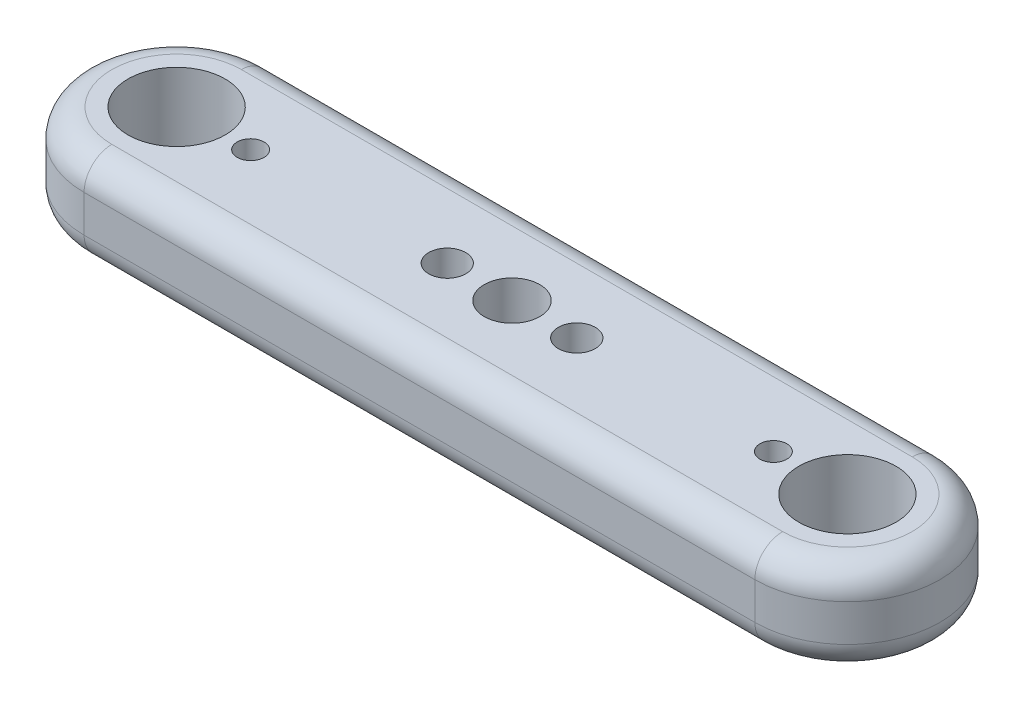
ISO-10303-21;
HEADER;
FILE_DESCRIPTION(('STEP AP214'),'2;1');
FILE_NAME('part.step','',(''),(''),'','','');
FILE_SCHEMA(('AUTOMOTIVE_DESIGN { 1 0 10303 214 1 1 1 1 }'));
ENDSEC;
DATA;
#1=APPLICATION_CONTEXT('core data for automotive mechanical design processes');
#2=APPLICATION_PROTOCOL_DEFINITION('international standard','automotive_design',2000,#1);
#3=PRODUCT_CONTEXT('',#1,'mechanical');
#4=PRODUCT('Part','Part','',(#3));
#5=PRODUCT_RELATED_PRODUCT_CATEGORY('part','',(#4));
#6=PRODUCT_DEFINITION_FORMATION('','',#4);
#7=PRODUCT_DEFINITION_CONTEXT('part definition',#1,'design');
#8=PRODUCT_DEFINITION('design','',#6,#7);
#9=PRODUCT_DEFINITION_SHAPE('','',#8);
#10=(LENGTH_UNIT() NAMED_UNIT(*) SI_UNIT(.MILLI.,.METRE.));
#11=(NAMED_UNIT(*) PLANE_ANGLE_UNIT() SI_UNIT($,.RADIAN.));
#12=(NAMED_UNIT(*) SI_UNIT($,.STERADIAN.) SOLID_ANGLE_UNIT());
#13=UNCERTAINTY_MEASURE_WITH_UNIT(LENGTH_MEASURE(1.E-05),#10,'distance_accuracy_value','');
#14=(GEOMETRIC_REPRESENTATION_CONTEXT(3) GLOBAL_UNCERTAINTY_ASSIGNED_CONTEXT((#13)) GLOBAL_UNIT_ASSIGNED_CONTEXT((#10,
#11,#12)) REPRESENTATION_CONTEXT('',''));
#15=CARTESIAN_POINT('',(0.,0.,0.));
#16=DIRECTION('',(0.,0.,1.));
#17=DIRECTION('',(1.,0.,0.));
#18=AXIS2_PLACEMENT_3D('',#15,#16,#17);
#19=CARTESIAN_POINT('',(0.,10.,10.));
#20=DIRECTION('',(0.,0.,1.));
#21=DIRECTION('',(1.,0.,0.));
#22=AXIS2_PLACEMENT_3D('',#19,#20,#21);
#23=PLANE('',#22);
#24=DIRECTION('',(0.,-1.,0.));
#25=VECTOR('',#24,1.);
#26=CARTESIAN_POINT('',(-36.25,10.,10.));
#27=LINE('',#26,#25);
#28=CARTESIAN_POINT('',(-36.25,7.,10.));
#29=VERTEX_POINT('',#28);
#30=CARTESIAN_POINT('',(-36.25,3.,10.));
#31=VERTEX_POINT('',#30);
#32=EDGE_CURVE('E109',#29,#31,#27,.T.);
#33=ORIENTED_EDGE('',*,*,#32,.T.);
#34=DIRECTION('',(-1.,0.,0.));
#35=VECTOR('',#34,1.);
#36=CARTESIAN_POINT('',(36.25,3.,10.));
#37=LINE('',#36,#35);
#38=CARTESIAN_POINT('',(36.25,3.,10.));
#39=VERTEX_POINT('',#38);
#40=EDGE_CURVE('E115',#31,#39,#37,.F.);
#41=ORIENTED_EDGE('',*,*,#40,.T.);
#42=DIRECTION('',(0.,-1.,0.));
#43=VECTOR('',#42,1.);
#44=CARTESIAN_POINT('',(36.25,10.,10.));
#45=LINE('',#44,#43);
#46=CARTESIAN_POINT('',(36.25,7.,10.));
#47=VERTEX_POINT('',#46);
#48=EDGE_CURVE('E111',#47,#39,#45,.T.);
#49=ORIENTED_EDGE('',*,*,#48,.F.);
#50=DIRECTION('',(-1.,0.,0.));
#51=VECTOR('',#50,1.);
#52=CARTESIAN_POINT('',(0.,7.,10.));
#53=LINE('',#52,#51);
#54=EDGE_CURVE('E107',#47,#29,#53,.T.);
#55=ORIENTED_EDGE('',*,*,#54,.T.);
#56=EDGE_LOOP('',(#33,#41,#49,#55));
#57=FACE_BOUND('',#56,.T.);
#58=ADVANCED_FACE('F38',(#57),#23,.T.);
#59=CARTESIAN_POINT('',(36.25,10.,0.));
#60=DIRECTION('',(0.,-1.,0.));
#61=DIRECTION('',(0.,0.,-1.));
#62=AXIS2_PLACEMENT_3D('',#59,#60,#61);
#63=CYLINDRICAL_SURFACE('',#62,10.);
#64=ORIENTED_EDGE('',*,*,#48,.T.);
#65=CARTESIAN_POINT('',(36.25,3.,0.));
#66=DIRECTION('',(0.,1.,0.));
#67=DIRECTION('',(0.,0.,1.));
#68=AXIS2_PLACEMENT_3D('',#65,#66,#67);
#69=CIRCLE('',#68,10.);
#70=CARTESIAN_POINT('',(36.25,3.,-10.));
#71=VERTEX_POINT('',#70);
#72=EDGE_CURVE('E176',#39,#71,#69,.T.);
#73=ORIENTED_EDGE('',*,*,#72,.T.);
#74=DIRECTION('',(0.,-1.,0.));
#75=VECTOR('',#74,1.);
#76=CARTESIAN_POINT('',(36.25,10.,-10.));
#77=LINE('',#76,#75);
#78=CARTESIAN_POINT('',(36.25,7.,-10.));
#79=VERTEX_POINT('',#78);
#80=EDGE_CURVE('E200',#79,#71,#77,.T.);
#81=ORIENTED_EDGE('',*,*,#80,.F.);
#82=CARTESIAN_POINT('',(36.25,7.,0.));
#83=DIRECTION('',(0.,1.,0.));
#84=DIRECTION('',(0.,0.,1.));
#85=AXIS2_PLACEMENT_3D('',#82,#83,#84);
#86=CIRCLE('',#85,10.);
#87=EDGE_CURVE('E187',#79,#47,#86,.F.);
#88=ORIENTED_EDGE('',*,*,#87,.T.);
#89=EDGE_LOOP('',(#64,#73,#81,#88));
#90=FACE_BOUND('',#89,.T.);
#91=ADVANCED_FACE('F203',(#90),#63,.T.);
#92=CARTESIAN_POINT('',(0.,10.,-10.));
#93=DIRECTION('',(0.,0.,-1.));
#94=DIRECTION('',(-1.,0.,0.));
#95=AXIS2_PLACEMENT_3D('',#92,#93,#94);
#96=PLANE('',#95);
#97=ORIENTED_EDGE('',*,*,#80,.T.);
#98=DIRECTION('',(1.,0.,0.));
#99=VECTOR('',#98,1.);
#100=CARTESIAN_POINT('',(-36.25,3.,-10.));
#101=LINE('',#100,#99);
#102=CARTESIAN_POINT('',(-36.25,3.,-10.));
#103=VERTEX_POINT('',#102);
#104=EDGE_CURVE('E11',#71,#103,#101,.F.);
#105=ORIENTED_EDGE('',*,*,#104,.T.);
#106=DIRECTION('',(0.,-1.,0.));
#107=VECTOR('',#106,1.);
#108=CARTESIAN_POINT('',(-36.25,10.,-10.));
#109=LINE('',#108,#107);
#110=CARTESIAN_POINT('',(-36.25,7.,-10.));
#111=VERTEX_POINT('',#110);
#112=EDGE_CURVE('E127',#111,#103,#109,.T.);
#113=ORIENTED_EDGE('',*,*,#112,.F.);
#114=DIRECTION('',(1.,0.,0.));
#115=VECTOR('',#114,1.);
#116=CARTESIAN_POINT('',(0.,7.,-10.));
#117=LINE('',#116,#115);
#118=EDGE_CURVE('E47',#111,#79,#117,.T.);
#119=ORIENTED_EDGE('',*,*,#118,.T.);
#120=EDGE_LOOP('',(#97,#105,#113,#119));
#121=FACE_BOUND('',#120,.T.);
#122=ADVANCED_FACE('F199',(#121),#96,.T.);
#123=CARTESIAN_POINT('',(-36.25,10.,0.));
#124=DIRECTION('',(0.,-1.,0.));
#125=DIRECTION('',(0.,0.,-1.));
#126=AXIS2_PLACEMENT_3D('',#123,#124,#125);
#127=CYLINDRICAL_SURFACE('',#126,10.);
#128=ORIENTED_EDGE('',*,*,#112,.T.);
#129=CARTESIAN_POINT('',(-36.25,3.,0.));
#130=DIRECTION('',(0.,1.,0.));
#131=DIRECTION('',(0.,0.,1.));
#132=AXIS2_PLACEMENT_3D('',#129,#130,#131);
#133=CIRCLE('',#132,10.);
#134=EDGE_CURVE('E126',#103,#31,#133,.T.);
#135=ORIENTED_EDGE('',*,*,#134,.T.);
#136=ORIENTED_EDGE('',*,*,#32,.F.);
#137=CARTESIAN_POINT('',(-36.25,7.,0.));
#138=DIRECTION('',(0.,1.,0.));
#139=DIRECTION('',(0.,0.,1.));
#140=AXIS2_PLACEMENT_3D('',#137,#138,#139);
#141=CIRCLE('',#140,10.);
#142=EDGE_CURVE('E123',#29,#111,#141,.F.);
#143=ORIENTED_EDGE('',*,*,#142,.T.);
#144=EDGE_LOOP('',(#128,#135,#136,#143));
#145=FACE_BOUND('',#144,.T.);
#146=ADVANCED_FACE('F122',(#145),#127,.T.);
#147=CARTESIAN_POINT('',(0.,10.,0.));
#148=DIRECTION('',(0.,1.,0.));
#149=DIRECTION('',(0.,0.,1.));
#150=AXIS2_PLACEMENT_3D('',#147,#148,#149);
#151=PLANE('',#150);
#152=CARTESIAN_POINT('',(-28.25,10.,0.));
#153=DIRECTION('',(0.,1.,0.));
#154=DIRECTION('',(0.,0.,1.));
#155=AXIS2_PLACEMENT_3D('',#152,#153,#154);
#156=CIRCLE('',#155,1.45);
#157=CARTESIAN_POINT('',(-28.25,10.,1.45));
#158=VERTEX_POINT('',#157);
#159=EDGE_CURVE('E378',#158,#158,#156,.T.);
#160=ORIENTED_EDGE('',*,*,#159,.F.);
#161=EDGE_LOOP('',(#160));
#162=FACE_BOUND('',#161,.T.);
#163=CARTESIAN_POINT('',(28.25,10.,0.));
#164=DIRECTION('',(0.,1.,0.));
#165=DIRECTION('',(0.,0.,1.));
#166=AXIS2_PLACEMENT_3D('',#163,#164,#165);
#167=CIRCLE('',#166,1.45);
#168=CARTESIAN_POINT('',(28.25,10.,1.45));
#169=VERTEX_POINT('',#168);
#170=EDGE_CURVE('E384',#169,#169,#167,.T.);
#171=ORIENTED_EDGE('',*,*,#170,.F.);
#172=EDGE_LOOP('',(#171));
#173=FACE_BOUND('',#172,.T.);
#174=CARTESIAN_POINT('',(-36.25,10.,0.));
#175=DIRECTION('',(0.,1.,0.));
#176=DIRECTION('',(0.,0.,1.));
#177=AXIS2_PLACEMENT_3D('',#174,#175,#176);
#178=CIRCLE('',#177,5.25);
#179=CARTESIAN_POINT('',(-36.25,10.,5.25));
#180=VERTEX_POINT('',#179);
#181=EDGE_CURVE('E393',#180,#180,#178,.T.);
#182=ORIENTED_EDGE('',*,*,#181,.F.);
#183=EDGE_LOOP('',(#182));
#184=FACE_BOUND('',#183,.T.);
#185=CARTESIAN_POINT('',(36.25,10.,0.));
#186=DIRECTION('',(0.,1.,0.));
#187=DIRECTION('',(0.,0.,1.));
#188=AXIS2_PLACEMENT_3D('',#185,#186,#187);
#189=CIRCLE('',#188,5.25);
#190=CARTESIAN_POINT('',(36.25,10.,5.25));
#191=VERTEX_POINT('',#190);
#192=EDGE_CURVE('E381',#191,#191,#189,.T.);
#193=ORIENTED_EDGE('',*,*,#192,.F.);
#194=EDGE_LOOP('',(#193));
#195=FACE_BOUND('',#194,.T.);
#196=CARTESIAN_POINT('',(0.,10.,0.));
#197=DIRECTION('',(0.,1.,0.));
#198=DIRECTION('',(0.,0.,1.));
#199=AXIS2_PLACEMENT_3D('',#196,#197,#198);
#200=CIRCLE('',#199,3.);
#201=CARTESIAN_POINT('',(0.,10.,3.));
#202=VERTEX_POINT('',#201);
#203=EDGE_CURVE('E392',#202,#202,#200,.T.);
#204=ORIENTED_EDGE('',*,*,#203,.F.);
#205=EDGE_LOOP('',(#204));
#206=FACE_BOUND('',#205,.T.);
#207=CARTESIAN_POINT('',(-7.,10.,0.));
#208=DIRECTION('',(0.,1.,0.));
#209=DIRECTION('',(0.,0.,1.));
#210=AXIS2_PLACEMENT_3D('',#207,#208,#209);
#211=CIRCLE('',#210,2.);
#212=CARTESIAN_POINT('',(-7.,10.,2.));
#213=VERTEX_POINT('',#212);
#214=EDGE_CURVE('E141',#213,#213,#211,.T.);
#215=ORIENTED_EDGE('',*,*,#214,.F.);
#216=EDGE_LOOP('',(#215));
#217=FACE_BOUND('',#216,.T.);
#218=CARTESIAN_POINT('',(7.,10.,0.));
#219=DIRECTION('',(0.,1.,0.));
#220=DIRECTION('',(0.,0.,1.));
#221=AXIS2_PLACEMENT_3D('',#218,#219,#220);
#222=CIRCLE('',#221,2.);
#223=CARTESIAN_POINT('',(7.,10.,2.));
#224=VERTEX_POINT('',#223);
#225=EDGE_CURVE('E404',#224,#224,#222,.T.);
#226=ORIENTED_EDGE('',*,*,#225,.F.);
#227=EDGE_LOOP('',(#226));
#228=FACE_BOUND('',#227,.T.);
#229=DIRECTION('',(1.,0.,0.));
#230=VECTOR('',#229,1.);
#231=CARTESIAN_POINT('',(0.,10.,-7.));
#232=LINE('',#231,#230);
#233=CARTESIAN_POINT('',(36.25,10.,-7.));
#234=VERTEX_POINT('',#233);
#235=CARTESIAN_POINT('',(-36.25,10.,-7.));
#236=VERTEX_POINT('',#235);
#237=EDGE_CURVE('E190',#234,#236,#232,.F.);
#238=ORIENTED_EDGE('',*,*,#237,.T.);
#239=CARTESIAN_POINT('',(-36.25,10.,0.));
#240=DIRECTION('',(0.,1.,0.));
#241=DIRECTION('',(0.,0.,1.));
#242=AXIS2_PLACEMENT_3D('',#239,#240,#241);
#243=CIRCLE('',#242,7.00000000000001);
#244=CARTESIAN_POINT('',(-36.25,10.,7.00000000000001));
#245=VERTEX_POINT('',#244);
#246=EDGE_CURVE('E195',#236,#245,#243,.T.);
#247=ORIENTED_EDGE('',*,*,#246,.T.);
#248=DIRECTION('',(-1.,0.,0.));
#249=VECTOR('',#248,1.);
#250=CARTESIAN_POINT('',(0.,10.,7.00000000000001));
#251=LINE('',#250,#249);
#252=CARTESIAN_POINT('',(36.25,10.,7.));
#253=VERTEX_POINT('',#252);
#254=EDGE_CURVE('E62',#245,#253,#251,.F.);
#255=ORIENTED_EDGE('',*,*,#254,.T.);
#256=CARTESIAN_POINT('',(36.25,10.,0.));
#257=DIRECTION('',(0.,1.,0.));
#258=DIRECTION('',(0.,0.,1.));
#259=AXIS2_PLACEMENT_3D('',#256,#257,#258);
#260=CIRCLE('',#259,7.);
#261=EDGE_CURVE('E192',#253,#234,#260,.T.);
#262=ORIENTED_EDGE('',*,*,#261,.T.);
#263=EDGE_LOOP('',(#238,#247,#255,#262));
#264=FACE_BOUND('',#263,.T.);
#265=ADVANCED_FACE('F206',(#162,#173,#184,#195,#206,#217,#228,#264),#151,.T.);
#266=CARTESIAN_POINT('',(0.,0.,0.));
#267=DIRECTION('',(0.,1.,0.));
#268=DIRECTION('',(0.,0.,1.));
#269=AXIS2_PLACEMENT_3D('',#266,#267,#268);
#270=PLANE('',#269);
#271=CARTESIAN_POINT('',(-28.25,0.,0.));
#272=DIRECTION('',(0.,1.,0.));
#273=DIRECTION('',(0.,0.,1.));
#274=AXIS2_PLACEMENT_3D('',#271,#272,#273);
#275=CIRCLE('',#274,1.45);
#276=CARTESIAN_POINT('',(-28.25,0.,1.45));
#277=VERTEX_POINT('',#276);
#278=EDGE_CURVE('E375',#277,#277,#275,.T.);
#279=ORIENTED_EDGE('',*,*,#278,.T.);
#280=EDGE_LOOP('',(#279));
#281=FACE_BOUND('',#280,.T.);
#282=CARTESIAN_POINT('',(28.25,0.,0.));
#283=DIRECTION('',(0.,1.,0.));
#284=DIRECTION('',(0.,0.,1.));
#285=AXIS2_PLACEMENT_3D('',#282,#283,#284);
#286=CIRCLE('',#285,1.45);
#287=CARTESIAN_POINT('',(28.25,0.,1.45));
#288=VERTEX_POINT('',#287);
#289=EDGE_CURVE('E379',#288,#288,#286,.T.);
#290=ORIENTED_EDGE('',*,*,#289,.T.);
#291=EDGE_LOOP('',(#290));
#292=FACE_BOUND('',#291,.T.);
#293=CARTESIAN_POINT('',(-36.25,0.,0.));
#294=DIRECTION('',(0.,1.,0.));
#295=DIRECTION('',(0.,0.,1.));
#296=AXIS2_PLACEMENT_3D('',#293,#294,#295);
#297=CIRCLE('',#296,5.25);
#298=CARTESIAN_POINT('',(-36.25,0.,5.25));
#299=VERTEX_POINT('',#298);
#300=EDGE_CURVE('E389',#299,#299,#297,.T.);
#301=ORIENTED_EDGE('',*,*,#300,.T.);
#302=EDGE_LOOP('',(#301));
#303=FACE_BOUND('',#302,.T.);
#304=CARTESIAN_POINT('',(36.25,0.,0.));
#305=DIRECTION('',(0.,1.,0.));
#306=DIRECTION('',(0.,0.,1.));
#307=AXIS2_PLACEMENT_3D('',#304,#305,#306);
#308=CIRCLE('',#307,5.25);
#309=CARTESIAN_POINT('',(36.25,0.,5.25));
#310=VERTEX_POINT('',#309);
#311=EDGE_CURVE('E396',#310,#310,#308,.T.);
#312=ORIENTED_EDGE('',*,*,#311,.T.);
#313=EDGE_LOOP('',(#312));
#314=FACE_BOUND('',#313,.T.);
#315=CARTESIAN_POINT('',(0.,0.,0.));
#316=DIRECTION('',(0.,1.,0.));
#317=DIRECTION('',(0.,0.,1.));
#318=AXIS2_PLACEMENT_3D('',#315,#316,#317);
#319=CIRCLE('',#318,3.);
#320=CARTESIAN_POINT('',(0.,0.,3.));
#321=VERTEX_POINT('',#320);
#322=EDGE_CURVE('E401',#321,#321,#319,.T.);
#323=ORIENTED_EDGE('',*,*,#322,.T.);
#324=EDGE_LOOP('',(#323));
#325=FACE_BOUND('',#324,.T.);
#326=CARTESIAN_POINT('',(-7.,0.,0.));
#327=DIRECTION('',(0.,1.,0.));
#328=DIRECTION('',(0.,0.,1.));
#329=AXIS2_PLACEMENT_3D('',#326,#327,#328);
#330=CIRCLE('',#329,2.);
#331=CARTESIAN_POINT('',(-7.,0.,2.));
#332=VERTEX_POINT('',#331);
#333=EDGE_CURVE('E136',#332,#332,#330,.T.);
#334=ORIENTED_EDGE('',*,*,#333,.T.);
#335=EDGE_LOOP('',(#334));
#336=FACE_BOUND('',#335,.T.);
#337=CARTESIAN_POINT('',(7.,0.,0.));
#338=DIRECTION('',(0.,1.,0.));
#339=DIRECTION('',(0.,0.,1.));
#340=AXIS2_PLACEMENT_3D('',#337,#338,#339);
#341=CIRCLE('',#340,2.);
#342=CARTESIAN_POINT('',(7.,0.,2.));
#343=VERTEX_POINT('',#342);
#344=EDGE_CURVE('E409',#343,#343,#341,.T.);
#345=ORIENTED_EDGE('',*,*,#344,.T.);
#346=EDGE_LOOP('',(#345));
#347=FACE_BOUND('',#346,.T.);
#348=DIRECTION('',(-1.,0.,0.));
#349=VECTOR('',#348,1.);
#350=CARTESIAN_POINT('',(-36.25,0.,7.00000000000001));
#351=LINE('',#350,#349);
#352=CARTESIAN_POINT('',(36.25,0.,7.));
#353=VERTEX_POINT('',#352);
#354=CARTESIAN_POINT('',(-36.25,0.,7.00000000000001));
#355=VERTEX_POINT('',#354);
#356=EDGE_CURVE('E179',#353,#355,#351,.T.);
#357=ORIENTED_EDGE('',*,*,#356,.T.);
#358=CARTESIAN_POINT('',(-36.25,0.,0.));
#359=DIRECTION('',(0.,1.,0.));
#360=DIRECTION('',(0.,0.,1.));
#361=AXIS2_PLACEMENT_3D('',#358,#359,#360);
#362=CIRCLE('',#361,7.00000000000001);
#363=CARTESIAN_POINT('',(-36.25,0.,-7.));
#364=VERTEX_POINT('',#363);
#365=EDGE_CURVE('E116',#355,#364,#362,.F.);
#366=ORIENTED_EDGE('',*,*,#365,.T.);
#367=DIRECTION('',(1.,0.,0.));
#368=VECTOR('',#367,1.);
#369=CARTESIAN_POINT('',(36.25,0.,-7.));
#370=LINE('',#369,#368);
#371=CARTESIAN_POINT('',(36.25,0.,-7.));
#372=VERTEX_POINT('',#371);
#373=EDGE_CURVE('E170',#364,#372,#370,.T.);
#374=ORIENTED_EDGE('',*,*,#373,.T.);
#375=CARTESIAN_POINT('',(36.25,0.,0.));
#376=DIRECTION('',(0.,1.,0.));
#377=DIRECTION('',(0.,0.,1.));
#378=AXIS2_PLACEMENT_3D('',#375,#376,#377);
#379=CIRCLE('',#378,7.);
#380=EDGE_CURVE('E177',#372,#353,#379,.F.);
#381=ORIENTED_EDGE('',*,*,#380,.T.);
#382=EDGE_LOOP('',(#357,#366,#374,#381));
#383=FACE_BOUND('',#382,.T.);
#384=ADVANCED_FACE('F232',(#281,#292,#303,#314,#325,#336,#347,#383),#270,.F.);
#385=CARTESIAN_POINT('',(36.25,3.,0.));
#386=DIRECTION('',(0.,1.,0.));
#387=DIRECTION('',(0.,0.,1.));
#388=AXIS2_PLACEMENT_3D('',#385,#386,#387);
#389=TOROIDAL_SURFACE('',#388,7.,3.);
#390=CARTESIAN_POINT('',(36.25,3.,7.));
#391=DIRECTION('',(-1.,0.,0.));
#392=DIRECTION('',(0.,0.,1.));
#393=AXIS2_PLACEMENT_3D('',#390,#391,#392);
#394=CIRCLE('',#393,3.);
#395=EDGE_CURVE('E156',#353,#39,#394,.T.);
#396=ORIENTED_EDGE('',*,*,#395,.F.);
#397=ORIENTED_EDGE('',*,*,#380,.F.);
#398=CARTESIAN_POINT('',(36.25,3.,-7.));
#399=DIRECTION('',(-1.,0.,0.));
#400=DIRECTION('',(0.,0.,1.));
#401=AXIS2_PLACEMENT_3D('',#398,#399,#400);
#402=CIRCLE('',#401,3.);
#403=EDGE_CURVE('E128',#71,#372,#402,.T.);
#404=ORIENTED_EDGE('',*,*,#403,.F.);
#405=ORIENTED_EDGE('',*,*,#72,.F.);
#406=EDGE_LOOP('',(#396,#397,#404,#405));
#407=FACE_BOUND('',#406,.T.);
#408=ADVANCED_FACE('F175',(#407),#389,.T.);
#409=CARTESIAN_POINT('',(0.,3.,-7.));
#410=DIRECTION('',(-1.,0.,0.));
#411=DIRECTION('',(0.,0.,1.));
#412=AXIS2_PLACEMENT_3D('',#409,#410,#411);
#413=CYLINDRICAL_SURFACE('',#412,3.);
#414=ORIENTED_EDGE('',*,*,#403,.T.);
#415=ORIENTED_EDGE('',*,*,#373,.F.);
#416=CARTESIAN_POINT('',(-36.25,3.,-7.));
#417=DIRECTION('',(-1.,0.,0.));
#418=DIRECTION('',(0.,0.,1.));
#419=AXIS2_PLACEMENT_3D('',#416,#417,#418);
#420=CIRCLE('',#419,3.);
#421=EDGE_CURVE('E150',#103,#364,#420,.T.);
#422=ORIENTED_EDGE('',*,*,#421,.F.);
#423=ORIENTED_EDGE('',*,*,#104,.F.);
#424=EDGE_LOOP('',(#414,#415,#422,#423));
#425=FACE_BOUND('',#424,.T.);
#426=ADVANCED_FACE('F168',(#425),#413,.T.);
#427=CARTESIAN_POINT('',(0.,3.,7.00000000000001));
#428=DIRECTION('',(1.,0.,0.));
#429=DIRECTION('',(0.,0.,-1.));
#430=AXIS2_PLACEMENT_3D('',#427,#428,#429);
#431=CYLINDRICAL_SURFACE('',#430,3.);
#432=ORIENTED_EDGE('',*,*,#395,.T.);
#433=ORIENTED_EDGE('',*,*,#40,.F.);
#434=CARTESIAN_POINT('',(-36.25,3.,7.00000000000001));
#435=DIRECTION('',(-1.,0.,0.));
#436=DIRECTION('',(0.,0.,1.));
#437=AXIS2_PLACEMENT_3D('',#434,#435,#436);
#438=CIRCLE('',#437,3.);
#439=EDGE_CURVE('E146',#355,#31,#438,.T.);
#440=ORIENTED_EDGE('',*,*,#439,.F.);
#441=ORIENTED_EDGE('',*,*,#356,.F.);
#442=EDGE_LOOP('',(#432,#433,#440,#441));
#443=FACE_BOUND('',#442,.T.);
#444=ADVANCED_FACE('F225',(#443),#431,.T.);
#445=CARTESIAN_POINT('',(-36.25,3.,0.));
#446=DIRECTION('',(0.,1.,0.));
#447=DIRECTION('',(0.,0.,1.));
#448=AXIS2_PLACEMENT_3D('',#445,#446,#447);
#449=TOROIDAL_SURFACE('',#448,7.00000000000001,3.);
#450=ORIENTED_EDGE('',*,*,#421,.T.);
#451=ORIENTED_EDGE('',*,*,#365,.F.);
#452=ORIENTED_EDGE('',*,*,#439,.T.);
#453=ORIENTED_EDGE('',*,*,#134,.F.);
#454=EDGE_LOOP('',(#450,#451,#452,#453));
#455=FACE_BOUND('',#454,.T.);
#456=ADVANCED_FACE('F214',(#455),#449,.T.);
#457=CARTESIAN_POINT('',(36.25,7.,0.));
#458=DIRECTION('',(0.,1.,0.));
#459=DIRECTION('',(0.,0.,1.));
#460=AXIS2_PLACEMENT_3D('',#457,#458,#459);
#461=TOROIDAL_SURFACE('',#460,7.,3.);
#462=CARTESIAN_POINT('',(36.25,7.,7.));
#463=DIRECTION('',(-1.,0.,0.));
#464=DIRECTION('',(0.,0.,1.));
#465=AXIS2_PLACEMENT_3D('',#462,#463,#464);
#466=CIRCLE('',#465,3.);
#467=EDGE_CURVE('E138',#47,#253,#466,.T.);
#468=ORIENTED_EDGE('',*,*,#467,.F.);
#469=ORIENTED_EDGE('',*,*,#87,.F.);
#470=CARTESIAN_POINT('',(36.25,7.,-7.));
#471=DIRECTION('',(-1.,0.,0.));
#472=DIRECTION('',(0.,0.,1.));
#473=AXIS2_PLACEMENT_3D('',#470,#471,#472);
#474=CIRCLE('',#473,3.);
#475=EDGE_CURVE('E42',#234,#79,#474,.T.);
#476=ORIENTED_EDGE('',*,*,#475,.F.);
#477=ORIENTED_EDGE('',*,*,#261,.F.);
#478=EDGE_LOOP('',(#468,#469,#476,#477));
#479=FACE_BOUND('',#478,.T.);
#480=ADVANCED_FACE('F40',(#479),#461,.T.);
#481=CARTESIAN_POINT('',(0.,7.,-7.));
#482=DIRECTION('',(1.,0.,0.));
#483=DIRECTION('',(0.,0.,-1.));
#484=AXIS2_PLACEMENT_3D('',#481,#482,#483);
#485=CYLINDRICAL_SURFACE('',#484,3.);
#486=ORIENTED_EDGE('',*,*,#475,.T.);
#487=ORIENTED_EDGE('',*,*,#118,.F.);
#488=CARTESIAN_POINT('',(-36.25,7.,-7.));
#489=DIRECTION('',(-1.,0.,0.));
#490=DIRECTION('',(0.,0.,1.));
#491=AXIS2_PLACEMENT_3D('',#488,#489,#490);
#492=CIRCLE('',#491,3.);
#493=EDGE_CURVE('E132',#236,#111,#492,.T.);
#494=ORIENTED_EDGE('',*,*,#493,.F.);
#495=ORIENTED_EDGE('',*,*,#237,.F.);
#496=EDGE_LOOP('',(#486,#487,#494,#495));
#497=FACE_BOUND('',#496,.T.);
#498=ADVANCED_FACE('F207',(#497),#485,.T.);
#499=CARTESIAN_POINT('',(0.,7.,7.00000000000001));
#500=DIRECTION('',(-1.,0.,0.));
#501=DIRECTION('',(0.,0.,1.));
#502=AXIS2_PLACEMENT_3D('',#499,#500,#501);
#503=CYLINDRICAL_SURFACE('',#502,3.);
#504=ORIENTED_EDGE('',*,*,#467,.T.);
#505=ORIENTED_EDGE('',*,*,#254,.F.);
#506=CARTESIAN_POINT('',(-36.25,7.,7.00000000000001));
#507=DIRECTION('',(-1.,0.,0.));
#508=DIRECTION('',(0.,0.,1.));
#509=AXIS2_PLACEMENT_3D('',#506,#507,#508);
#510=CIRCLE('',#509,3.);
#511=EDGE_CURVE('E55',#29,#245,#510,.T.);
#512=ORIENTED_EDGE('',*,*,#511,.F.);
#513=ORIENTED_EDGE('',*,*,#54,.F.);
#514=EDGE_LOOP('',(#504,#505,#512,#513));
#515=FACE_BOUND('',#514,.T.);
#516=ADVANCED_FACE('F135',(#515),#503,.T.);
#517=CARTESIAN_POINT('',(-36.25,7.,0.));
#518=DIRECTION('',(0.,1.,0.));
#519=DIRECTION('',(0.,0.,1.));
#520=AXIS2_PLACEMENT_3D('',#517,#518,#519);
#521=TOROIDAL_SURFACE('',#520,7.00000000000001,3.);
#522=ORIENTED_EDGE('',*,*,#493,.T.);
#523=ORIENTED_EDGE('',*,*,#142,.F.);
#524=ORIENTED_EDGE('',*,*,#511,.T.);
#525=ORIENTED_EDGE('',*,*,#246,.F.);
#526=EDGE_LOOP('',(#522,#523,#524,#525));
#527=FACE_BOUND('',#526,.T.);
#528=ADVANCED_FACE('F130',(#527),#521,.T.);
#529=CARTESIAN_POINT('',(7.,0.,0.));
#530=DIRECTION('',(0.,1.,0.));
#531=DIRECTION('',(0.,0.,1.));
#532=AXIS2_PLACEMENT_3D('',#529,#530,#531);
#533=CYLINDRICAL_SURFACE('',#532,2.);
#534=ORIENTED_EDGE('',*,*,#344,.F.);
#535=EDGE_LOOP('',(#534));
#536=FACE_BOUND('',#535,.T.);
#537=ORIENTED_EDGE('',*,*,#225,.T.);
#538=EDGE_LOOP('',(#537));
#539=FACE_BOUND('',#538,.T.);
#540=ADVANCED_FACE('F234',(#536,#539),#533,.F.);
#541=CARTESIAN_POINT('',(-7.,0.,0.));
#542=DIRECTION('',(0.,1.,0.));
#543=DIRECTION('',(0.,0.,1.));
#544=AXIS2_PLACEMENT_3D('',#541,#542,#543);
#545=CYLINDRICAL_SURFACE('',#544,2.);
#546=ORIENTED_EDGE('',*,*,#333,.F.);
#547=EDGE_LOOP('',(#546));
#548=FACE_BOUND('',#547,.T.);
#549=ORIENTED_EDGE('',*,*,#214,.T.);
#550=EDGE_LOOP('',(#549));
#551=FACE_BOUND('',#550,.T.);
#552=ADVANCED_FACE('F238',(#548,#551),#545,.F.);
#553=CARTESIAN_POINT('',(0.,0.,0.));
#554=DIRECTION('',(0.,1.,0.));
#555=DIRECTION('',(0.,0.,1.));
#556=AXIS2_PLACEMENT_3D('',#553,#554,#555);
#557=CYLINDRICAL_SURFACE('',#556,3.);
#558=ORIENTED_EDGE('',*,*,#322,.F.);
#559=EDGE_LOOP('',(#558));
#560=FACE_BOUND('',#559,.T.);
#561=ORIENTED_EDGE('',*,*,#203,.T.);
#562=EDGE_LOOP('',(#561));
#563=FACE_BOUND('',#562,.T.);
#564=ADVANCED_FACE('F244',(#560,#563),#557,.F.);
#565=CARTESIAN_POINT('',(36.25,0.,0.));
#566=DIRECTION('',(0.,1.,0.));
#567=DIRECTION('',(0.,0.,1.));
#568=AXIS2_PLACEMENT_3D('',#565,#566,#567);
#569=CYLINDRICAL_SURFACE('',#568,5.25);
#570=ORIENTED_EDGE('',*,*,#311,.F.);
#571=EDGE_LOOP('',(#570));
#572=FACE_BOUND('',#571,.T.);
#573=ORIENTED_EDGE('',*,*,#192,.T.);
#574=EDGE_LOOP('',(#573));
#575=FACE_BOUND('',#574,.T.);
#576=ADVANCED_FACE('F331',(#572,#575),#569,.F.);
#577=CARTESIAN_POINT('',(-36.25,0.,0.));
#578=DIRECTION('',(0.,1.,0.));
#579=DIRECTION('',(0.,0.,1.));
#580=AXIS2_PLACEMENT_3D('',#577,#578,#579);
#581=CYLINDRICAL_SURFACE('',#580,5.25);
#582=ORIENTED_EDGE('',*,*,#300,.F.);
#583=EDGE_LOOP('',(#582));
#584=FACE_BOUND('',#583,.T.);
#585=ORIENTED_EDGE('',*,*,#181,.T.);
#586=EDGE_LOOP('',(#585));
#587=FACE_BOUND('',#586,.T.);
#588=ADVANCED_FACE('F339',(#584,#587),#581,.F.);
#589=CARTESIAN_POINT('',(28.25,0.,0.));
#590=DIRECTION('',(0.,1.,0.));
#591=DIRECTION('',(0.,0.,1.));
#592=AXIS2_PLACEMENT_3D('',#589,#590,#591);
#593=CYLINDRICAL_SURFACE('',#592,1.45);
#594=ORIENTED_EDGE('',*,*,#289,.F.);
#595=EDGE_LOOP('',(#594));
#596=FACE_BOUND('',#595,.T.);
#597=ORIENTED_EDGE('',*,*,#170,.T.);
#598=EDGE_LOOP('',(#597));
#599=FACE_BOUND('',#598,.T.);
#600=ADVANCED_FACE('F348',(#596,#599),#593,.F.);
#601=CARTESIAN_POINT('',(-28.25,0.,0.));
#602=DIRECTION('',(0.,1.,0.));
#603=DIRECTION('',(0.,0.,1.));
#604=AXIS2_PLACEMENT_3D('',#601,#602,#603);
#605=CYLINDRICAL_SURFACE('',#604,1.45);
#606=ORIENTED_EDGE('',*,*,#278,.F.);
#607=EDGE_LOOP('',(#606));
#608=FACE_BOUND('',#607,.T.);
#609=ORIENTED_EDGE('',*,*,#159,.T.);
#610=EDGE_LOOP('',(#609));
#611=FACE_BOUND('',#610,.T.);
#612=ADVANCED_FACE('F358',(#608,#611),#605,.F.);
#613=CLOSED_SHELL('',(#58,#91,#122,#146,#265,#384,#408,#426,#444,#456,#480,#498,#516,#528,#540,
#552,#564,#576,#588,#600,#612));
#614=MANIFOLD_SOLID_BREP('B2',#613);
#615=ADVANCED_BREP_SHAPE_REPRESENTATION('',(#18,#614),#14);
#616=SHAPE_DEFINITION_REPRESENTATION(#9,#615);
ENDSEC;
END-ISO-10303-21;
